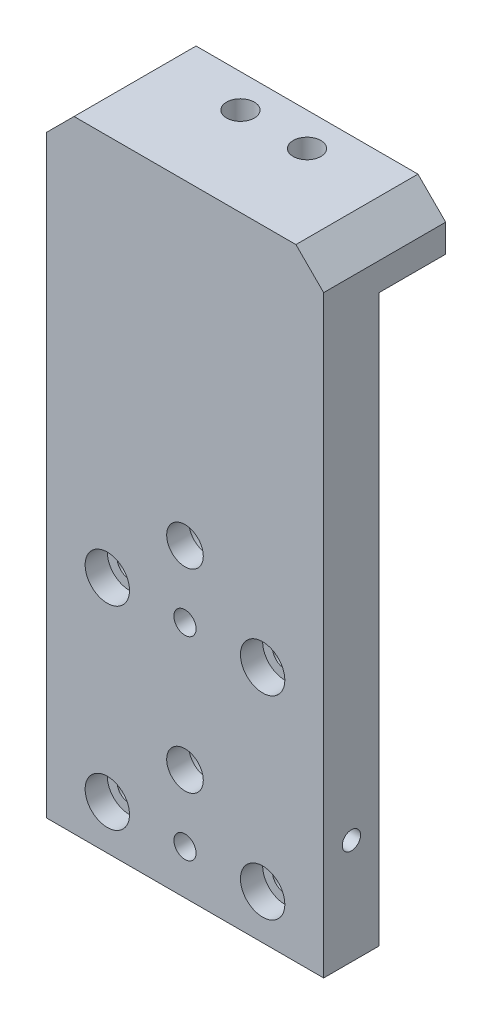
ISO-10303-21;
HEADER;
FILE_DESCRIPTION(('STEP AP214'),'2;1');
FILE_NAME('part.step','',(''),(''),'','','');
FILE_SCHEMA(('AUTOMOTIVE_DESIGN { 1 0 10303 214 1 1 1 1 }'));
ENDSEC;
DATA;
#1=APPLICATION_CONTEXT('core data for automotive mechanical design processes');
#2=APPLICATION_PROTOCOL_DEFINITION('international standard','automotive_design',2000,#1);
#3=PRODUCT_CONTEXT('',#1,'mechanical');
#4=PRODUCT('Part','Part','',(#3));
#5=PRODUCT_RELATED_PRODUCT_CATEGORY('part','',(#4));
#6=PRODUCT_DEFINITION_FORMATION('','',#4);
#7=PRODUCT_DEFINITION_CONTEXT('part definition',#1,'design');
#8=PRODUCT_DEFINITION('design','',#6,#7);
#9=PRODUCT_DEFINITION_SHAPE('','',#8);
#10=(LENGTH_UNIT() NAMED_UNIT(*) SI_UNIT(.MILLI.,.METRE.));
#11=(NAMED_UNIT(*) PLANE_ANGLE_UNIT() SI_UNIT($,.RADIAN.));
#12=(NAMED_UNIT(*) SI_UNIT($,.STERADIAN.) SOLID_ANGLE_UNIT());
#13=UNCERTAINTY_MEASURE_WITH_UNIT(LENGTH_MEASURE(1.E-05),#10,'distance_accuracy_value','');
#14=(GEOMETRIC_REPRESENTATION_CONTEXT(3) GLOBAL_UNCERTAINTY_ASSIGNED_CONTEXT((#13)) GLOBAL_UNIT_ASSIGNED_CONTEXT((#10,
#11,#12)) REPRESENTATION_CONTEXT('',''));
#15=CARTESIAN_POINT('',(0.,0.,0.));
#16=DIRECTION('',(0.,0.,1.));
#17=DIRECTION('',(1.,0.,0.));
#18=AXIS2_PLACEMENT_3D('',#15,#16,#17);
#19=CARTESIAN_POINT('',(0.,0.,0.));
#20=DIRECTION('',(0.,0.,1.));
#21=DIRECTION('',(1.,0.,0.));
#22=AXIS2_PLACEMENT_3D('',#19,#20,#21);
#23=PLANE('',#22);
#24=CARTESIAN_POINT('',(4.32330827067674,-79.8458646616541,0.));
#25=DIRECTION('',(0.,0.,1.));
#26=DIRECTION('',(1.,0.,0.));
#27=AXIS2_PLACEMENT_3D('',#24,#25,#26);
#28=CIRCLE('',#27,2.);
#29=CARTESIAN_POINT('',(6.32330827067674,-79.8458646616541,0.));
#30=VERTEX_POINT('',#29);
#31=EDGE_CURVE('E194',#30,#30,#28,.T.);
#32=ORIENTED_EDGE('',*,*,#31,.T.);
#33=EDGE_LOOP('',(#32));
#34=FACE_BOUND('',#33,.T.);
#35=CARTESIAN_POINT('',(18.3233082706767,-44.8458646616541,0.));
#36=DIRECTION('',(0.,0.,1.));
#37=DIRECTION('',(1.,0.,0.));
#38=AXIS2_PLACEMENT_3D('',#35,#36,#37);
#39=CIRCLE('',#38,2.25);
#40=CARTESIAN_POINT('',(20.5733082706767,-44.8458646616541,0.));
#41=VERTEX_POINT('',#40);
#42=EDGE_CURVE('E193',#41,#41,#39,.T.);
#43=ORIENTED_EDGE('',*,*,#42,.T.);
#44=EDGE_LOOP('',(#43));
#45=FACE_BOUND('',#44,.T.);
#46=CARTESIAN_POINT('',(-9.67669172932327,-44.8458646616541,0.));
#47=DIRECTION('',(0.,0.,1.));
#48=DIRECTION('',(1.,0.,0.));
#49=AXIS2_PLACEMENT_3D('',#46,#47,#48);
#50=CIRCLE('',#49,2.25);
#51=CARTESIAN_POINT('',(-7.42669172932326,-44.8458646616541,0.));
#52=VERTEX_POINT('',#51);
#53=EDGE_CURVE('E199',#52,#52,#50,.T.);
#54=ORIENTED_EDGE('',*,*,#53,.T.);
#55=EDGE_LOOP('',(#54));
#56=FACE_BOUND('',#55,.T.);
#57=CARTESIAN_POINT('',(-9.67669172932327,-79.8458646616541,0.));
#58=DIRECTION('',(0.,0.,1.));
#59=DIRECTION('',(1.,0.,0.));
#60=AXIS2_PLACEMENT_3D('',#57,#58,#59);
#61=CIRCLE('',#60,2.25);
#62=CARTESIAN_POINT('',(-7.42669172932326,-79.8458646616541,0.));
#63=VERTEX_POINT('',#62);
#64=EDGE_CURVE('E202',#63,#63,#61,.T.);
#65=ORIENTED_EDGE('',*,*,#64,.T.);
#66=EDGE_LOOP('',(#65));
#67=FACE_BOUND('',#66,.T.);
#68=CARTESIAN_POINT('',(18.3233082706767,-79.8458646616541,0.));
#69=DIRECTION('',(0.,0.,1.));
#70=DIRECTION('',(1.,0.,0.));
#71=AXIS2_PLACEMENT_3D('',#68,#69,#70);
#72=CIRCLE('',#71,2.25);
#73=CARTESIAN_POINT('',(20.5733082706767,-79.8458646616541,0.));
#74=VERTEX_POINT('',#73);
#75=EDGE_CURVE('E205',#74,#74,#72,.T.);
#76=ORIENTED_EDGE('',*,*,#75,.T.);
#77=EDGE_LOOP('',(#76));
#78=FACE_BOUND('',#77,.T.);
#79=CARTESIAN_POINT('',(4.32330827067674,-44.8458646616541,0.));
#80=DIRECTION('',(0.,0.,1.));
#81=DIRECTION('',(1.,0.,0.));
#82=AXIS2_PLACEMENT_3D('',#79,#80,#81);
#83=CIRCLE('',#82,2.);
#84=CARTESIAN_POINT('',(6.32330827067674,-44.8458646616541,0.));
#85=VERTEX_POINT('',#84);
#86=EDGE_CURVE('E211',#85,#85,#83,.T.);
#87=ORIENTED_EDGE('',*,*,#86,.T.);
#88=EDGE_LOOP('',(#87));
#89=FACE_BOUND('',#88,.T.);
#90=CARTESIAN_POINT('',(4.32330827067674,-32.8458646616541,0.));
#91=DIRECTION('',(0.,0.,-1.));
#92=DIRECTION('',(-1.,0.,0.));
#93=AXIS2_PLACEMENT_3D('',#90,#91,#92);
#94=CIRCLE('',#93,5.5);
#95=CARTESIAN_POINT('',(-1.17669172932326,-32.8458646616541,0.));
#96=VERTEX_POINT('',#95);
#97=EDGE_CURVE('E187',#96,#96,#94,.T.);
#98=ORIENTED_EDGE('',*,*,#97,.F.);
#99=EDGE_LOOP('',(#98));
#100=FACE_BOUND('',#99,.T.);
#101=CARTESIAN_POINT('',(4.32330827067674,-67.8458646616541,0.));
#102=DIRECTION('',(0.,0.,-1.));
#103=DIRECTION('',(-1.,0.,0.));
#104=AXIS2_PLACEMENT_3D('',#101,#102,#103);
#105=CIRCLE('',#104,5.5);
#106=CARTESIAN_POINT('',(-1.17669172932326,-67.8458646616541,0.));
#107=VERTEX_POINT('',#106);
#108=EDGE_CURVE('E180',#107,#107,#105,.T.);
#109=ORIENTED_EDGE('',*,*,#108,.F.);
#110=EDGE_LOOP('',(#109));
#111=FACE_BOUND('',#110,.T.);
#112=DIRECTION('',(-1.,0.,0.));
#113=VECTOR('',#112,1.);
#114=CARTESIAN_POINT('',(29.3233082706767,14.1541353383459,0.));
#115=LINE('',#114,#113);
#116=CARTESIAN_POINT('',(29.3233082706767,14.1541353383459,0.));
#117=VERTEX_POINT('',#116);
#118=CARTESIAN_POINT('',(-20.6766917293233,14.1541353383459,0.));
#119=VERTEX_POINT('',#118);
#120=EDGE_CURVE('E130',#117,#119,#115,.T.);
#121=ORIENTED_EDGE('',*,*,#120,.F.);
#122=DIRECTION('',(0.,1.,0.));
#123=VECTOR('',#122,1.);
#124=CARTESIAN_POINT('',(29.3233082706767,24.1541353383459,0.));
#125=LINE('',#124,#123);
#126=CARTESIAN_POINT('',(29.3233082706767,-87.8458646616541,0.));
#127=VERTEX_POINT('',#126);
#128=EDGE_CURVE('E224',#127,#117,#125,.T.);
#129=ORIENTED_EDGE('',*,*,#128,.F.);
#130=DIRECTION('',(1.,0.,0.));
#131=VECTOR('',#130,1.);
#132=CARTESIAN_POINT('',(-20.6766917293233,-87.8458646616541,0.));
#133=LINE('',#132,#131);
#134=CARTESIAN_POINT('',(-20.6766917293233,-87.8458646616541,0.));
#135=VERTEX_POINT('',#134);
#136=EDGE_CURVE('E232',#135,#127,#133,.T.);
#137=ORIENTED_EDGE('',*,*,#136,.F.);
#138=DIRECTION('',(0.,-1.,0.));
#139=VECTOR('',#138,1.);
#140=CARTESIAN_POINT('',(-20.6766917293233,24.1541353383459,0.));
#141=LINE('',#140,#139);
#142=EDGE_CURVE('E220',#119,#135,#141,.T.);
#143=ORIENTED_EDGE('',*,*,#142,.F.);
#144=EDGE_LOOP('',(#121,#129,#137,#143));
#145=FACE_BOUND('',#144,.T.);
#146=ADVANCED_FACE('F35',(#34,#45,#56,#67,#78,#89,#100,#111,#145),#23,.F.);
#147=CARTESIAN_POINT('',(18.3233082706767,-79.8458646616541,10.));
#148=DIRECTION('',(0.,0.,-1.));
#149=DIRECTION('',(-1.,0.,0.));
#150=AXIS2_PLACEMENT_3D('',#147,#148,#149);
#151=CYLINDRICAL_SURFACE('',#150,2.25);
#152=ORIENTED_EDGE('',*,*,#75,.F.);
#153=EDGE_LOOP('',(#152));
#154=FACE_BOUND('',#153,.T.);
#155=CARTESIAN_POINT('',(18.3233082706767,-79.8458646616541,6.));
#156=DIRECTION('',(0.,0.,1.));
#157=DIRECTION('',(1.,0.,0.));
#158=AXIS2_PLACEMENT_3D('',#155,#156,#157);
#159=CIRCLE('',#158,2.25);
#160=CARTESIAN_POINT('',(20.5733082706767,-79.8458646616541,6.));
#161=VERTEX_POINT('',#160);
#162=EDGE_CURVE('E175',#161,#161,#159,.T.);
#163=ORIENTED_EDGE('',*,*,#162,.T.);
#164=EDGE_LOOP('',(#163));
#165=FACE_BOUND('',#164,.T.);
#166=ADVANCED_FACE('F309',(#154,#165),#151,.F.);
#167=CARTESIAN_POINT('',(-9.67669172932327,-79.8458646616541,10.));
#168=DIRECTION('',(0.,0.,-1.));
#169=DIRECTION('',(-1.,0.,0.));
#170=AXIS2_PLACEMENT_3D('',#167,#168,#169);
#171=CYLINDRICAL_SURFACE('',#170,2.25);
#172=ORIENTED_EDGE('',*,*,#64,.F.);
#173=EDGE_LOOP('',(#172));
#174=FACE_BOUND('',#173,.T.);
#175=CARTESIAN_POINT('',(-9.67669172932327,-79.8458646616541,6.));
#176=DIRECTION('',(0.,0.,1.));
#177=DIRECTION('',(1.,0.,0.));
#178=AXIS2_PLACEMENT_3D('',#175,#176,#177);
#179=CIRCLE('',#178,2.25);
#180=CARTESIAN_POINT('',(-7.42669172932326,-79.8458646616541,6.));
#181=VERTEX_POINT('',#180);
#182=EDGE_CURVE('E250',#181,#181,#179,.T.);
#183=ORIENTED_EDGE('',*,*,#182,.T.);
#184=EDGE_LOOP('',(#183));
#185=FACE_BOUND('',#184,.T.);
#186=ADVANCED_FACE('F315',(#174,#185),#171,.F.);
#187=CARTESIAN_POINT('',(18.3233082706767,-44.8458646616541,10.));
#188=DIRECTION('',(0.,0.,-1.));
#189=DIRECTION('',(-1.,0.,0.));
#190=AXIS2_PLACEMENT_3D('',#187,#188,#189);
#191=CYLINDRICAL_SURFACE('',#190,2.25);
#192=ORIENTED_EDGE('',*,*,#42,.F.);
#193=EDGE_LOOP('',(#192));
#194=FACE_BOUND('',#193,.T.);
#195=CARTESIAN_POINT('',(18.3233082706767,-44.8458646616541,6.));
#196=DIRECTION('',(0.,0.,1.));
#197=DIRECTION('',(1.,0.,0.));
#198=AXIS2_PLACEMENT_3D('',#195,#196,#197);
#199=CIRCLE('',#198,2.25);
#200=CARTESIAN_POINT('',(20.5733082706767,-44.8458646616541,6.));
#201=VERTEX_POINT('',#200);
#202=EDGE_CURVE('E153',#201,#201,#199,.T.);
#203=ORIENTED_EDGE('',*,*,#202,.T.);
#204=EDGE_LOOP('',(#203));
#205=FACE_BOUND('',#204,.T.);
#206=ADVANCED_FACE('F424',(#194,#205),#191,.F.);
#207=CARTESIAN_POINT('',(-9.67669172932327,-44.8458646616541,10.));
#208=DIRECTION('',(0.,0.,-1.));
#209=DIRECTION('',(-1.,0.,0.));
#210=AXIS2_PLACEMENT_3D('',#207,#208,#209);
#211=CYLINDRICAL_SURFACE('',#210,2.25);
#212=ORIENTED_EDGE('',*,*,#53,.F.);
#213=EDGE_LOOP('',(#212));
#214=FACE_BOUND('',#213,.T.);
#215=CARTESIAN_POINT('',(-9.67669172932327,-44.8458646616541,6.));
#216=DIRECTION('',(0.,0.,1.));
#217=DIRECTION('',(1.,0.,0.));
#218=AXIS2_PLACEMENT_3D('',#215,#216,#217);
#219=CIRCLE('',#218,2.25);
#220=CARTESIAN_POINT('',(-7.42669172932326,-44.8458646616541,6.));
#221=VERTEX_POINT('',#220);
#222=EDGE_CURVE('E171',#221,#221,#219,.T.);
#223=ORIENTED_EDGE('',*,*,#222,.T.);
#224=EDGE_LOOP('',(#223));
#225=FACE_BOUND('',#224,.T.);
#226=ADVANCED_FACE('F427',(#214,#225),#211,.F.);
#227=CARTESIAN_POINT('',(4.32330827067674,-67.8458646616541,10.));
#228=DIRECTION('',(0.,0.,-1.));
#229=DIRECTION('',(-1.,0.,0.));
#230=AXIS2_PLACEMENT_3D('',#227,#228,#229);
#231=CYLINDRICAL_SURFACE('',#230,3.3);
#232=CARTESIAN_POINT('',(4.32330827067674,-67.8458646616541,10.));
#233=DIRECTION('',(0.,0.,1.));
#234=DIRECTION('',(1.,0.,0.));
#235=AXIS2_PLACEMENT_3D('',#232,#233,#234);
#236=CIRCLE('',#235,3.3);
#237=CARTESIAN_POINT('',(7.62330827067673,-67.8458646616541,10.));
#238=VERTEX_POINT('',#237);
#239=EDGE_CURVE('E215',#238,#238,#236,.T.);
#240=ORIENTED_EDGE('',*,*,#239,.T.);
#241=EDGE_LOOP('',(#240));
#242=FACE_BOUND('',#241,.T.);
#243=CARTESIAN_POINT('',(4.32330827067674,-67.8458646616541,6.));
#244=DIRECTION('',(0.,0.,-1.));
#245=DIRECTION('',(-1.,0.,0.));
#246=AXIS2_PLACEMENT_3D('',#243,#244,#245);
#247=CIRCLE('',#246,3.3);
#248=CARTESIAN_POINT('',(1.02330827067674,-67.8458646616541,6.));
#249=VERTEX_POINT('',#248);
#250=EDGE_CURVE('E179',#249,#249,#247,.T.);
#251=ORIENTED_EDGE('',*,*,#250,.T.);
#252=EDGE_LOOP('',(#251));
#253=FACE_BOUND('',#252,.T.);
#254=ADVANCED_FACE('F431',(#242,#253),#231,.F.);
#255=CARTESIAN_POINT('',(4.32330827067674,-32.8458646616541,10.));
#256=DIRECTION('',(0.,0.,-1.));
#257=DIRECTION('',(-1.,0.,0.));
#258=AXIS2_PLACEMENT_3D('',#255,#256,#257);
#259=CYLINDRICAL_SURFACE('',#258,3.3);
#260=CARTESIAN_POINT('',(4.32330827067674,-32.8458646616541,10.));
#261=DIRECTION('',(0.,0.,1.));
#262=DIRECTION('',(1.,0.,0.));
#263=AXIS2_PLACEMENT_3D('',#260,#261,#262);
#264=CIRCLE('',#263,3.3);
#265=CARTESIAN_POINT('',(7.62330827067673,-32.8458646616541,10.));
#266=VERTEX_POINT('',#265);
#267=EDGE_CURVE('E208',#266,#266,#264,.T.);
#268=ORIENTED_EDGE('',*,*,#267,.T.);
#269=EDGE_LOOP('',(#268));
#270=FACE_BOUND('',#269,.T.);
#271=CARTESIAN_POINT('',(4.32330827067674,-32.8458646616541,6.));
#272=DIRECTION('',(0.,0.,-1.));
#273=DIRECTION('',(-1.,0.,0.));
#274=AXIS2_PLACEMENT_3D('',#271,#272,#273);
#275=CIRCLE('',#274,3.3);
#276=CARTESIAN_POINT('',(1.02330827067674,-32.8458646616541,6.));
#277=VERTEX_POINT('',#276);
#278=EDGE_CURVE('E186',#277,#277,#275,.T.);
#279=ORIENTED_EDGE('',*,*,#278,.T.);
#280=EDGE_LOOP('',(#279));
#281=FACE_BOUND('',#280,.T.);
#282=ADVANCED_FACE('F436',(#270,#281),#259,.F.);
#283=CARTESIAN_POINT('',(0.,0.,10.));
#284=DIRECTION('',(0.,0.,1.));
#285=DIRECTION('',(1.,0.,0.));
#286=AXIS2_PLACEMENT_3D('',#283,#284,#285);
#287=PLANE('',#286);
#288=CARTESIAN_POINT('',(18.3233082706767,-44.8458646616541,10.));
#289=DIRECTION('',(0.,0.,1.));
#290=DIRECTION('',(1.,0.,0.));
#291=AXIS2_PLACEMENT_3D('',#288,#289,#290);
#292=CIRCLE('',#291,4.);
#293=CARTESIAN_POINT('',(22.3233082706767,-44.8458646616541,10.));
#294=VERTEX_POINT('',#293);
#295=EDGE_CURVE('E154',#294,#294,#292,.T.);
#296=ORIENTED_EDGE('',*,*,#295,.F.);
#297=EDGE_LOOP('',(#296));
#298=FACE_BOUND('',#297,.T.);
#299=CARTESIAN_POINT('',(18.3233082706767,-79.8458646616541,10.));
#300=DIRECTION('',(0.,0.,1.));
#301=DIRECTION('',(1.,0.,0.));
#302=AXIS2_PLACEMENT_3D('',#299,#300,#301);
#303=CIRCLE('',#302,4.);
#304=CARTESIAN_POINT('',(22.3233082706767,-79.8458646616541,10.));
#305=VERTEX_POINT('',#304);
#306=EDGE_CURVE('E160',#305,#305,#303,.T.);
#307=ORIENTED_EDGE('',*,*,#306,.F.);
#308=EDGE_LOOP('',(#307));
#309=FACE_BOUND('',#308,.T.);
#310=CARTESIAN_POINT('',(-9.67669172932327,-79.8458646616541,10.));
#311=DIRECTION('',(0.,0.,1.));
#312=DIRECTION('',(1.,0.,0.));
#313=AXIS2_PLACEMENT_3D('',#310,#311,#312);
#314=CIRCLE('',#313,4.);
#315=CARTESIAN_POINT('',(-5.67669172932326,-79.8458646616541,10.));
#316=VERTEX_POINT('',#315);
#317=EDGE_CURVE('E149',#316,#316,#314,.T.);
#318=ORIENTED_EDGE('',*,*,#317,.F.);
#319=EDGE_LOOP('',(#318));
#320=FACE_BOUND('',#319,.T.);
#321=CARTESIAN_POINT('',(-9.67669172932327,-44.8458646616541,10.));
#322=DIRECTION('',(0.,0.,1.));
#323=DIRECTION('',(1.,0.,0.));
#324=AXIS2_PLACEMENT_3D('',#321,#322,#323);
#325=CIRCLE('',#324,4.);
#326=CARTESIAN_POINT('',(-5.67669172932326,-44.8458646616541,10.));
#327=VERTEX_POINT('',#326);
#328=EDGE_CURVE('E172',#327,#327,#325,.T.);
#329=ORIENTED_EDGE('',*,*,#328,.F.);
#330=EDGE_LOOP('',(#329));
#331=FACE_BOUND('',#330,.T.);
#332=ORIENTED_EDGE('',*,*,#267,.F.);
#333=EDGE_LOOP('',(#332));
#334=FACE_BOUND('',#333,.T.);
#335=ORIENTED_EDGE('',*,*,#239,.F.);
#336=EDGE_LOOP('',(#335));
#337=FACE_BOUND('',#336,.T.);
#338=DIRECTION('',(-1.,0.,0.));
#339=VECTOR('',#338,1.);
#340=CARTESIAN_POINT('',(-20.6766917293233,24.1541353383459,10.));
#341=LINE('',#340,#339);
#342=CARTESIAN_POINT('',(24.3233082706767,24.1541353383459,10.));
#343=VERTEX_POINT('',#342);
#344=CARTESIAN_POINT('',(-15.6766917293233,24.1541353383459,10.));
#345=VERTEX_POINT('',#344);
#346=EDGE_CURVE('E228',#343,#345,#341,.T.);
#347=ORIENTED_EDGE('',*,*,#346,.T.);
#348=DIRECTION('',(0.707106781186549,0.707106781186547,0.));
#349=VECTOR('',#348,1.);
#350=CARTESIAN_POINT('',(-19.9154135338345,19.9154135338346,10.));
#351=LINE('',#350,#349);
#352=CARTESIAN_POINT('',(-20.6766917293233,19.1541353383459,10.));
#353=VERTEX_POINT('',#352);
#354=EDGE_CURVE('E44',#345,#353,#351,.F.);
#355=ORIENTED_EDGE('',*,*,#354,.T.);
#356=DIRECTION('',(0.,-1.,0.));
#357=VECTOR('',#356,1.);
#358=CARTESIAN_POINT('',(-20.6766917293233,24.1541353383459,10.));
#359=LINE('',#358,#357);
#360=CARTESIAN_POINT('',(-20.6766917293233,-87.8458646616541,10.));
#361=VERTEX_POINT('',#360);
#362=EDGE_CURVE('E221',#353,#361,#359,.T.);
#363=ORIENTED_EDGE('',*,*,#362,.T.);
#364=DIRECTION('',(1.,0.,0.));
#365=VECTOR('',#364,1.);
#366=CARTESIAN_POINT('',(-20.6766917293233,-87.8458646616541,10.));
#367=LINE('',#366,#365);
#368=CARTESIAN_POINT('',(29.3233082706767,-87.8458646616541,10.));
#369=VERTEX_POINT('',#368);
#370=EDGE_CURVE('E223',#361,#369,#367,.T.);
#371=ORIENTED_EDGE('',*,*,#370,.T.);
#372=DIRECTION('',(0.,1.,0.));
#373=VECTOR('',#372,1.);
#374=CARTESIAN_POINT('',(29.3233082706767,24.1541353383459,10.));
#375=LINE('',#374,#373);
#376=CARTESIAN_POINT('',(29.3233082706767,19.1541353383458,10.));
#377=VERTEX_POINT('',#376);
#378=EDGE_CURVE('E226',#369,#377,#375,.T.);
#379=ORIENTED_EDGE('',*,*,#378,.T.);
#380=DIRECTION('',(0.707106781186547,-0.707106781186549,0.));
#381=VECTOR('',#380,1.);
#382=CARTESIAN_POINT('',(24.2387218045113,24.2387218045113,10.));
#383=LINE('',#382,#381);
#384=EDGE_CURVE('E265',#377,#343,#383,.F.);
#385=ORIENTED_EDGE('',*,*,#384,.T.);
#386=EDGE_LOOP('',(#347,#355,#363,#371,#379,#385));
#387=FACE_BOUND('',#386,.T.);
#388=CARTESIAN_POINT('',(4.32330827067674,-44.8458646616541,10.));
#389=DIRECTION('',(0.,0.,1.));
#390=DIRECTION('',(1.,0.,0.));
#391=AXIS2_PLACEMENT_3D('',#388,#389,#390);
#392=CIRCLE('',#391,2.);
#393=CARTESIAN_POINT('',(6.32330827067674,-44.8458646616541,10.));
#394=VERTEX_POINT('',#393);
#395=EDGE_CURVE('E212',#394,#394,#392,.T.);
#396=ORIENTED_EDGE('',*,*,#395,.F.);
#397=EDGE_LOOP('',(#396));
#398=FACE_BOUND('',#397,.T.);
#399=CARTESIAN_POINT('',(4.32330827067674,-79.8458646616541,10.));
#400=DIRECTION('',(0.,0.,1.));
#401=DIRECTION('',(1.,0.,0.));
#402=AXIS2_PLACEMENT_3D('',#399,#400,#401);
#403=CIRCLE('',#402,2.);
#404=CARTESIAN_POINT('',(6.32330827067674,-79.8458646616541,10.));
#405=VERTEX_POINT('',#404);
#406=EDGE_CURVE('E190',#405,#405,#403,.T.);
#407=ORIENTED_EDGE('',*,*,#406,.F.);
#408=EDGE_LOOP('',(#407));
#409=FACE_BOUND('',#408,.T.);
#410=ADVANCED_FACE('F270',(#298,#309,#320,#331,#334,#337,#387,#398,#409),#287,.T.);
#411=CARTESIAN_POINT('',(-20.6766917293233,24.1541353383459,10.));
#412=DIRECTION('',(1.,0.,0.));
#413=DIRECTION('',(0.,1.,0.));
#414=AXIS2_PLACEMENT_3D('',#411,#412,#413);
#415=PLANE('',#414);
#416=CARTESIAN_POINT('',(-20.6766917293233,-68.8458646616541,5.));
#417=DIRECTION('',(-1.,0.,0.));
#418=DIRECTION('',(0.,0.,1.));
#419=AXIS2_PLACEMENT_3D('',#416,#417,#418);
#420=CIRCLE('',#419,1.64999999999998);
#421=CARTESIAN_POINT('',(-20.6766917293233,-68.8458646616541,6.64999999999999));
#422=VERTEX_POINT('',#421);
#423=EDGE_CURVE('E118',#422,#422,#420,.T.);
#424=ORIENTED_EDGE('',*,*,#423,.F.);
#425=EDGE_LOOP('',(#424));
#426=FACE_BOUND('',#425,.T.);
#427=ORIENTED_EDGE('',*,*,#362,.F.);
#428=DIRECTION('',(0.,0.,-1.));
#429=VECTOR('',#428,1.);
#430=CARTESIAN_POINT('',(-20.6766917293233,19.1541353383459,10.));
#431=LINE('',#430,#429);
#432=CARTESIAN_POINT('',(-20.6766917293233,19.1541353383459,-12.));
#433=VERTEX_POINT('',#432);
#434=EDGE_CURVE('E241',#353,#433,#431,.T.);
#435=ORIENTED_EDGE('',*,*,#434,.T.);
#436=DIRECTION('',(0.,1.,0.));
#437=VECTOR('',#436,1.);
#438=CARTESIAN_POINT('',(-20.6766917293233,24.1541353383459,-12.));
#439=LINE('',#438,#437);
#440=CARTESIAN_POINT('',(-20.6766917293233,14.1541353383459,-12.));
#441=VERTEX_POINT('',#440);
#442=EDGE_CURVE('E135',#441,#433,#439,.T.);
#443=ORIENTED_EDGE('',*,*,#442,.F.);
#444=DIRECTION('',(0.,0.,1.));
#445=VECTOR('',#444,1.);
#446=CARTESIAN_POINT('',(-20.6766917293233,14.1541353383459,-12.));
#447=LINE('',#446,#445);
#448=EDGE_CURVE('E141',#441,#119,#447,.T.);
#449=ORIENTED_EDGE('',*,*,#448,.T.);
#450=ORIENTED_EDGE('',*,*,#142,.T.);
#451=DIRECTION('',(0.,0.,-1.));
#452=VECTOR('',#451,1.);
#453=CARTESIAN_POINT('',(-20.6766917293233,-87.8458646616541,10.));
#454=LINE('',#453,#452);
#455=EDGE_CURVE('E238',#361,#135,#454,.T.);
#456=ORIENTED_EDGE('',*,*,#455,.F.);
#457=EDGE_LOOP('',(#427,#435,#443,#449,#450,#456));
#458=FACE_BOUND('',#457,.T.);
#459=ADVANCED_FACE('F277',(#426,#458),#415,.F.);
#460=CARTESIAN_POINT('',(-20.6766917293233,-87.8458646616541,10.));
#461=DIRECTION('',(0.,1.,0.));
#462=DIRECTION('',(0.,0.,1.));
#463=AXIS2_PLACEMENT_3D('',#460,#461,#462);
#464=PLANE('',#463);
#465=ORIENTED_EDGE('',*,*,#136,.T.);
#466=DIRECTION('',(0.,0.,-1.));
#467=VECTOR('',#466,1.);
#468=CARTESIAN_POINT('',(29.3233082706767,-87.8458646616541,10.));
#469=LINE('',#468,#467);
#470=EDGE_CURVE('E230',#369,#127,#469,.T.);
#471=ORIENTED_EDGE('',*,*,#470,.F.);
#472=ORIENTED_EDGE('',*,*,#370,.F.);
#473=ORIENTED_EDGE('',*,*,#455,.T.);
#474=EDGE_LOOP('',(#465,#471,#472,#473));
#475=FACE_BOUND('',#474,.T.);
#476=ADVANCED_FACE('F297',(#475),#464,.F.);
#477=CARTESIAN_POINT('',(29.3233082706767,24.1541353383459,10.));
#478=DIRECTION('',(-1.,0.,0.));
#479=DIRECTION('',(0.,-1.,0.));
#480=AXIS2_PLACEMENT_3D('',#477,#478,#479);
#481=PLANE('',#480);
#482=CARTESIAN_POINT('',(29.3233082706767,-68.8458646616541,5.));
#483=DIRECTION('',(1.,0.,0.));
#484=DIRECTION('',(0.,0.,-1.));
#485=AXIS2_PLACEMENT_3D('',#482,#483,#484);
#486=CIRCLE('',#485,1.65);
#487=CARTESIAN_POINT('',(29.3233082706767,-68.8458646616541,3.35));
#488=VERTEX_POINT('',#487);
#489=EDGE_CURVE('E117',#488,#488,#486,.T.);
#490=ORIENTED_EDGE('',*,*,#489,.F.);
#491=EDGE_LOOP('',(#490));
#492=FACE_BOUND('',#491,.T.);
#493=DIRECTION('',(0.,-1.,0.));
#494=VECTOR('',#493,1.);
#495=CARTESIAN_POINT('',(29.3233082706767,24.1541353383459,-12.));
#496=LINE('',#495,#494);
#497=CARTESIAN_POINT('',(29.3233082706767,19.1541353383458,-12.));
#498=VERTEX_POINT('',#497);
#499=CARTESIAN_POINT('',(29.3233082706767,14.1541353383459,-12.));
#500=VERTEX_POINT('',#499);
#501=EDGE_CURVE('E131',#498,#500,#496,.T.);
#502=ORIENTED_EDGE('',*,*,#501,.F.);
#503=DIRECTION('',(0.,0.,1.));
#504=VECTOR('',#503,1.);
#505=CARTESIAN_POINT('',(29.3233082706767,19.1541353383458,10.));
#506=LINE('',#505,#504);
#507=EDGE_CURVE('E11',#498,#377,#506,.T.);
#508=ORIENTED_EDGE('',*,*,#507,.T.);
#509=ORIENTED_EDGE('',*,*,#378,.F.);
#510=ORIENTED_EDGE('',*,*,#470,.T.);
#511=ORIENTED_EDGE('',*,*,#128,.T.);
#512=DIRECTION('',(0.,0.,1.));
#513=VECTOR('',#512,1.);
#514=CARTESIAN_POINT('',(29.3233082706767,14.1541353383459,-12.));
#515=LINE('',#514,#513);
#516=EDGE_CURVE('E146',#500,#117,#515,.T.);
#517=ORIENTED_EDGE('',*,*,#516,.F.);
#518=EDGE_LOOP('',(#502,#508,#509,#510,#511,#517));
#519=FACE_BOUND('',#518,.T.);
#520=ADVANCED_FACE('F288',(#492,#519),#481,.F.);
#521=CARTESIAN_POINT('',(-20.6766917293233,24.1541353383459,10.));
#522=DIRECTION('',(0.,-1.,0.));
#523=DIRECTION('',(0.,0.,-1.));
#524=AXIS2_PLACEMENT_3D('',#521,#522,#523);
#525=PLANE('',#524);
#526=CARTESIAN_POINT('',(10.3233082706767,24.1541353383459,-6.));
#527=DIRECTION('',(0.,1.,0.));
#528=DIRECTION('',(0.,0.,1.));
#529=AXIS2_PLACEMENT_3D('',#526,#527,#528);
#530=CIRCLE('',#529,2.5);
#531=CARTESIAN_POINT('',(10.3233082706767,24.1541353383459,-3.5));
#532=VERTEX_POINT('',#531);
#533=EDGE_CURVE('E334',#532,#532,#530,.T.);
#534=ORIENTED_EDGE('',*,*,#533,.F.);
#535=EDGE_LOOP('',(#534));
#536=FACE_BOUND('',#535,.T.);
#537=CARTESIAN_POINT('',(-1.67669172932328,24.1541353383459,-6.));
#538=DIRECTION('',(0.,1.,0.));
#539=DIRECTION('',(0.,0.,1.));
#540=AXIS2_PLACEMENT_3D('',#537,#538,#539);
#541=CIRCLE('',#540,2.5);
#542=CARTESIAN_POINT('',(-1.67669172932328,24.1541353383459,-3.5));
#543=VERTEX_POINT('',#542);
#544=EDGE_CURVE('E337',#543,#543,#541,.T.);
#545=ORIENTED_EDGE('',*,*,#544,.F.);
#546=EDGE_LOOP('',(#545));
#547=FACE_BOUND('',#546,.T.);
#548=DIRECTION('',(1.,0.,0.));
#549=VECTOR('',#548,1.);
#550=CARTESIAN_POINT('',(29.3233082706767,24.1541353383459,-12.));
#551=LINE('',#550,#549);
#552=CARTESIAN_POINT('',(-15.6766917293233,24.1541353383459,-12.));
#553=VERTEX_POINT('',#552);
#554=CARTESIAN_POINT('',(24.3233082706767,24.1541353383459,-12.));
#555=VERTEX_POINT('',#554);
#556=EDGE_CURVE('E138',#553,#555,#551,.T.);
#557=ORIENTED_EDGE('',*,*,#556,.F.);
#558=DIRECTION('',(0.,0.,1.));
#559=VECTOR('',#558,1.);
#560=CARTESIAN_POINT('',(-15.6766917293233,24.1541353383459,10.));
#561=LINE('',#560,#559);
#562=EDGE_CURVE('E57',#553,#345,#561,.T.);
#563=ORIENTED_EDGE('',*,*,#562,.T.);
#564=ORIENTED_EDGE('',*,*,#346,.F.);
#565=DIRECTION('',(0.,0.,-1.));
#566=VECTOR('',#565,1.);
#567=CARTESIAN_POINT('',(24.3233082706767,24.1541353383459,10.));
#568=LINE('',#567,#566);
#569=EDGE_CURVE('E261',#343,#555,#568,.T.);
#570=ORIENTED_EDGE('',*,*,#569,.T.);
#571=EDGE_LOOP('',(#557,#563,#564,#570));
#572=FACE_BOUND('',#571,.T.);
#573=ADVANCED_FACE('F282',(#536,#547,#572),#525,.F.);
#574=CARTESIAN_POINT('',(4.32330827067674,-44.8458646616541,10.));
#575=DIRECTION('',(0.,0.,-1.));
#576=DIRECTION('',(-1.,0.,0.));
#577=AXIS2_PLACEMENT_3D('',#574,#575,#576);
#578=CYLINDRICAL_SURFACE('',#577,2.);
#579=ORIENTED_EDGE('',*,*,#395,.T.);
#580=EDGE_LOOP('',(#579));
#581=FACE_BOUND('',#580,.T.);
#582=ORIENTED_EDGE('',*,*,#86,.F.);
#583=EDGE_LOOP('',(#582));
#584=FACE_BOUND('',#583,.T.);
#585=ADVANCED_FACE('F323',(#581,#584),#578,.F.);
#586=CARTESIAN_POINT('',(4.32330827067674,-79.8458646616541,10.));
#587=DIRECTION('',(0.,0.,-1.));
#588=DIRECTION('',(-1.,0.,0.));
#589=AXIS2_PLACEMENT_3D('',#586,#587,#588);
#590=CYLINDRICAL_SURFACE('',#589,2.);
#591=ORIENTED_EDGE('',*,*,#406,.T.);
#592=EDGE_LOOP('',(#591));
#593=FACE_BOUND('',#592,.T.);
#594=ORIENTED_EDGE('',*,*,#31,.F.);
#595=EDGE_LOOP('',(#594));
#596=FACE_BOUND('',#595,.T.);
#597=ADVANCED_FACE('F328',(#593,#596),#590,.F.);
#598=CARTESIAN_POINT('',(4.32330827067674,-32.8458646616541,6.));
#599=DIRECTION('',(0.,0.,-1.));
#600=DIRECTION('',(-1.,0.,0.));
#601=AXIS2_PLACEMENT_3D('',#598,#599,#600);
#602=CYLINDRICAL_SURFACE('',#601,5.5);
#603=CARTESIAN_POINT('',(4.32330827067674,-32.8458646616541,6.));
#604=DIRECTION('',(0.,0.,-1.));
#605=DIRECTION('',(-1.,0.,0.));
#606=AXIS2_PLACEMENT_3D('',#603,#604,#605);
#607=CIRCLE('',#606,5.5);
#608=CARTESIAN_POINT('',(-1.17669172932326,-32.8458646616541,6.));
#609=VERTEX_POINT('',#608);
#610=EDGE_CURVE('E183',#609,#609,#607,.T.);
#611=ORIENTED_EDGE('',*,*,#610,.F.);
#612=EDGE_LOOP('',(#611));
#613=FACE_BOUND('',#612,.T.);
#614=ORIENTED_EDGE('',*,*,#97,.T.);
#615=EDGE_LOOP('',(#614));
#616=FACE_BOUND('',#615,.T.);
#617=ADVANCED_FACE('F416',(#613,#616),#602,.F.);
#618=CARTESIAN_POINT('',(4.32330827067674,-32.8458646616541,6.));
#619=DIRECTION('',(0.,0.,-1.));
#620=DIRECTION('',(-1.,0.,0.));
#621=AXIS2_PLACEMENT_3D('',#618,#619,#620);
#622=PLANE('',#621);
#623=ORIENTED_EDGE('',*,*,#278,.F.);
#624=EDGE_LOOP('',(#623));
#625=FACE_BOUND('',#624,.T.);
#626=ORIENTED_EDGE('',*,*,#610,.T.);
#627=EDGE_LOOP('',(#626));
#628=FACE_BOUND('',#627,.T.);
#629=ADVANCED_FACE('F412',(#625,#628),#622,.T.);
#630=CARTESIAN_POINT('',(4.32330827067674,-67.8458646616541,6.));
#631=DIRECTION('',(0.,0.,-1.));
#632=DIRECTION('',(-1.,0.,0.));
#633=AXIS2_PLACEMENT_3D('',#630,#631,#632);
#634=CYLINDRICAL_SURFACE('',#633,5.5);
#635=CARTESIAN_POINT('',(4.32330827067674,-67.8458646616541,6.));
#636=DIRECTION('',(0.,0.,-1.));
#637=DIRECTION('',(-1.,0.,0.));
#638=AXIS2_PLACEMENT_3D('',#635,#636,#637);
#639=CIRCLE('',#638,5.5);
#640=CARTESIAN_POINT('',(-1.17669172932326,-67.8458646616541,6.));
#641=VERTEX_POINT('',#640);
#642=EDGE_CURVE('E176',#641,#641,#639,.T.);
#643=ORIENTED_EDGE('',*,*,#642,.F.);
#644=EDGE_LOOP('',(#643));
#645=FACE_BOUND('',#644,.T.);
#646=ORIENTED_EDGE('',*,*,#108,.T.);
#647=EDGE_LOOP('',(#646));
#648=FACE_BOUND('',#647,.T.);
#649=ADVANCED_FACE('F408',(#645,#648),#634,.F.);
#650=CARTESIAN_POINT('',(4.32330827067674,-67.8458646616541,6.));
#651=DIRECTION('',(0.,0.,-1.));
#652=DIRECTION('',(-1.,0.,0.));
#653=AXIS2_PLACEMENT_3D('',#650,#651,#652);
#654=PLANE('',#653);
#655=ORIENTED_EDGE('',*,*,#250,.F.);
#656=EDGE_LOOP('',(#655));
#657=FACE_BOUND('',#656,.T.);
#658=ORIENTED_EDGE('',*,*,#642,.T.);
#659=EDGE_LOOP('',(#658));
#660=FACE_BOUND('',#659,.T.);
#661=ADVANCED_FACE('F404',(#657,#660),#654,.T.);
#662=CARTESIAN_POINT('',(-9.67669172932327,-44.8458646616541,6.));
#663=DIRECTION('',(0.,0.,1.));
#664=DIRECTION('',(1.,0.,0.));
#665=AXIS2_PLACEMENT_3D('',#662,#663,#664);
#666=CYLINDRICAL_SURFACE('',#665,4.);
#667=CARTESIAN_POINT('',(-9.67669172932327,-44.8458646616541,6.));
#668=DIRECTION('',(0.,0.,1.));
#669=DIRECTION('',(1.,0.,0.));
#670=AXIS2_PLACEMENT_3D('',#667,#668,#669);
#671=CIRCLE('',#670,4.);
#672=CARTESIAN_POINT('',(-5.67669172932326,-44.8458646616541,6.));
#673=VERTEX_POINT('',#672);
#674=EDGE_CURVE('E168',#673,#673,#671,.T.);
#675=ORIENTED_EDGE('',*,*,#674,.F.);
#676=EDGE_LOOP('',(#675));
#677=FACE_BOUND('',#676,.T.);
#678=ORIENTED_EDGE('',*,*,#328,.T.);
#679=EDGE_LOOP('',(#678));
#680=FACE_BOUND('',#679,.T.);
#681=ADVANCED_FACE('F400',(#677,#680),#666,.F.);
#682=CARTESIAN_POINT('',(-9.67669172932327,-44.8458646616541,6.));
#683=DIRECTION('',(0.,0.,1.));
#684=DIRECTION('',(1.,0.,0.));
#685=AXIS2_PLACEMENT_3D('',#682,#683,#684);
#686=PLANE('',#685);
#687=ORIENTED_EDGE('',*,*,#222,.F.);
#688=EDGE_LOOP('',(#687));
#689=FACE_BOUND('',#688,.T.);
#690=ORIENTED_EDGE('',*,*,#674,.T.);
#691=EDGE_LOOP('',(#690));
#692=FACE_BOUND('',#691,.T.);
#693=ADVANCED_FACE('F382',(#689,#692),#686,.T.);
#694=CARTESIAN_POINT('',(18.3233082706767,-44.8458646616541,6.));
#695=DIRECTION('',(0.,0.,1.));
#696=DIRECTION('',(1.,0.,0.));
#697=AXIS2_PLACEMENT_3D('',#694,#695,#696);
#698=CYLINDRICAL_SURFACE('',#697,4.);
#699=CARTESIAN_POINT('',(18.3233082706767,-44.8458646616541,6.));
#700=DIRECTION('',(0.,0.,1.));
#701=DIRECTION('',(1.,0.,0.));
#702=AXIS2_PLACEMENT_3D('',#699,#700,#701);
#703=CIRCLE('',#702,4.);
#704=CARTESIAN_POINT('',(22.3233082706767,-44.8458646616541,6.));
#705=VERTEX_POINT('',#704);
#706=EDGE_CURVE('E150',#705,#705,#703,.T.);
#707=ORIENTED_EDGE('',*,*,#706,.F.);
#708=EDGE_LOOP('',(#707));
#709=FACE_BOUND('',#708,.T.);
#710=ORIENTED_EDGE('',*,*,#295,.T.);
#711=EDGE_LOOP('',(#710));
#712=FACE_BOUND('',#711,.T.);
#713=ADVANCED_FACE('F378',(#709,#712),#698,.F.);
#714=CARTESIAN_POINT('',(18.3233082706767,-44.8458646616541,6.));
#715=DIRECTION('',(0.,0.,1.));
#716=DIRECTION('',(1.,0.,0.));
#717=AXIS2_PLACEMENT_3D('',#714,#715,#716);
#718=PLANE('',#717);
#719=ORIENTED_EDGE('',*,*,#202,.F.);
#720=EDGE_LOOP('',(#719));
#721=FACE_BOUND('',#720,.T.);
#722=ORIENTED_EDGE('',*,*,#706,.T.);
#723=EDGE_LOOP('',(#722));
#724=FACE_BOUND('',#723,.T.);
#725=ADVANCED_FACE('F374',(#721,#724),#718,.T.);
#726=CARTESIAN_POINT('',(-9.67669172932327,-79.8458646616541,6.));
#727=DIRECTION('',(0.,0.,1.));
#728=DIRECTION('',(1.,0.,0.));
#729=AXIS2_PLACEMENT_3D('',#726,#727,#728);
#730=CYLINDRICAL_SURFACE('',#729,4.);
#731=CARTESIAN_POINT('',(-9.67669172932327,-79.8458646616541,6.));
#732=DIRECTION('',(0.,0.,1.));
#733=DIRECTION('',(1.,0.,0.));
#734=AXIS2_PLACEMENT_3D('',#731,#732,#733);
#735=CIRCLE('',#734,4.);
#736=CARTESIAN_POINT('',(-5.67669172932326,-79.8458646616541,6.));
#737=VERTEX_POINT('',#736);
#738=EDGE_CURVE('E163',#737,#737,#735,.T.);
#739=ORIENTED_EDGE('',*,*,#738,.F.);
#740=EDGE_LOOP('',(#739));
#741=FACE_BOUND('',#740,.T.);
#742=ORIENTED_EDGE('',*,*,#317,.T.);
#743=EDGE_LOOP('',(#742));
#744=FACE_BOUND('',#743,.T.);
#745=ADVANCED_FACE('F377',(#741,#744),#730,.F.);
#746=CARTESIAN_POINT('',(-9.67669172932327,-79.8458646616541,6.));
#747=DIRECTION('',(0.,0.,1.));
#748=DIRECTION('',(1.,0.,0.));
#749=AXIS2_PLACEMENT_3D('',#746,#747,#748);
#750=PLANE('',#749);
#751=ORIENTED_EDGE('',*,*,#182,.F.);
#752=EDGE_LOOP('',(#751));
#753=FACE_BOUND('',#752,.T.);
#754=ORIENTED_EDGE('',*,*,#738,.T.);
#755=EDGE_LOOP('',(#754));
#756=FACE_BOUND('',#755,.T.);
#757=ADVANCED_FACE('F390',(#753,#756),#750,.T.);
#758=CARTESIAN_POINT('',(18.3233082706767,-79.8458646616541,6.));
#759=DIRECTION('',(0.,0.,1.));
#760=DIRECTION('',(1.,0.,0.));
#761=AXIS2_PLACEMENT_3D('',#758,#759,#760);
#762=CYLINDRICAL_SURFACE('',#761,4.);
#763=CARTESIAN_POINT('',(18.3233082706767,-79.8458646616541,6.));
#764=DIRECTION('',(0.,0.,1.));
#765=DIRECTION('',(1.,0.,0.));
#766=AXIS2_PLACEMENT_3D('',#763,#764,#765);
#767=CIRCLE('',#766,4.);
#768=CARTESIAN_POINT('',(22.3233082706767,-79.8458646616541,6.));
#769=VERTEX_POINT('',#768);
#770=EDGE_CURVE('E157',#769,#769,#767,.T.);
#771=ORIENTED_EDGE('',*,*,#770,.F.);
#772=EDGE_LOOP('',(#771));
#773=FACE_BOUND('',#772,.T.);
#774=ORIENTED_EDGE('',*,*,#306,.T.);
#775=EDGE_LOOP('',(#774));
#776=FACE_BOUND('',#775,.T.);
#777=ADVANCED_FACE('F386',(#773,#776),#762,.F.);
#778=CARTESIAN_POINT('',(18.3233082706767,-79.8458646616541,6.));
#779=DIRECTION('',(0.,0.,1.));
#780=DIRECTION('',(1.,0.,0.));
#781=AXIS2_PLACEMENT_3D('',#778,#779,#780);
#782=PLANE('',#781);
#783=ORIENTED_EDGE('',*,*,#162,.F.);
#784=EDGE_LOOP('',(#783));
#785=FACE_BOUND('',#784,.T.);
#786=ORIENTED_EDGE('',*,*,#770,.T.);
#787=EDGE_LOOP('',(#786));
#788=FACE_BOUND('',#787,.T.);
#789=ADVANCED_FACE('F353',(#785,#788),#782,.T.);
#790=CARTESIAN_POINT('',(29.3233082706767,14.1541353383459,-12.));
#791=DIRECTION('',(0.,1.,0.));
#792=DIRECTION('',(0.,0.,1.));
#793=AXIS2_PLACEMENT_3D('',#790,#791,#792);
#794=PLANE('',#793);
#795=CARTESIAN_POINT('',(10.3233082706767,14.1541353383459,-6.));
#796=DIRECTION('',(0.,1.,0.));
#797=DIRECTION('',(0.,0.,1.));
#798=AXIS2_PLACEMENT_3D('',#795,#796,#797);
#799=CIRCLE('',#798,2.5);
#800=CARTESIAN_POINT('',(10.3233082706767,14.1541353383459,-3.5));
#801=VERTEX_POINT('',#800);
#802=EDGE_CURVE('E39',#801,#801,#799,.T.);
#803=ORIENTED_EDGE('',*,*,#802,.T.);
#804=EDGE_LOOP('',(#803));
#805=FACE_BOUND('',#804,.T.);
#806=CARTESIAN_POINT('',(-1.67669172932328,14.1541353383459,-6.));
#807=DIRECTION('',(0.,1.,0.));
#808=DIRECTION('',(0.,0.,1.));
#809=AXIS2_PLACEMENT_3D('',#806,#807,#808);
#810=CIRCLE('',#809,2.5);
#811=CARTESIAN_POINT('',(-1.67669172932328,14.1541353383459,-3.5));
#812=VERTEX_POINT('',#811);
#813=EDGE_CURVE('E124',#812,#812,#810,.T.);
#814=ORIENTED_EDGE('',*,*,#813,.T.);
#815=EDGE_LOOP('',(#814));
#816=FACE_BOUND('',#815,.T.);
#817=ORIENTED_EDGE('',*,*,#120,.T.);
#818=ORIENTED_EDGE('',*,*,#448,.F.);
#819=DIRECTION('',(-1.,0.,0.));
#820=VECTOR('',#819,1.);
#821=CARTESIAN_POINT('',(29.3233082706767,14.1541353383459,-12.));
#822=LINE('',#821,#820);
#823=EDGE_CURVE('E133',#500,#441,#822,.T.);
#824=ORIENTED_EDGE('',*,*,#823,.F.);
#825=ORIENTED_EDGE('',*,*,#516,.T.);
#826=EDGE_LOOP('',(#817,#818,#824,#825));
#827=FACE_BOUND('',#826,.T.);
#828=ADVANCED_FACE('F291',(#805,#816,#827),#794,.F.);
#829=CARTESIAN_POINT('',(0.,0.,-12.));
#830=DIRECTION('',(0.,0.,-1.));
#831=DIRECTION('',(-1.,0.,0.));
#832=AXIS2_PLACEMENT_3D('',#829,#830,#831);
#833=PLANE('',#832);
#834=ORIENTED_EDGE('',*,*,#442,.T.);
#835=DIRECTION('',(-0.707106781186549,-0.707106781186547,0.));
#836=VECTOR('',#835,1.);
#837=CARTESIAN_POINT('',(-19.9154135338345,19.9154135338346,-12.));
#838=LINE('',#837,#836);
#839=EDGE_CURVE('E259',#433,#553,#838,.F.);
#840=ORIENTED_EDGE('',*,*,#839,.T.);
#841=ORIENTED_EDGE('',*,*,#556,.T.);
#842=DIRECTION('',(-0.707106781186547,0.707106781186549,0.));
#843=VECTOR('',#842,1.);
#844=CARTESIAN_POINT('',(24.2387218045113,24.2387218045113,-12.));
#845=LINE('',#844,#843);
#846=EDGE_CURVE('E257',#555,#498,#845,.F.);
#847=ORIENTED_EDGE('',*,*,#846,.T.);
#848=ORIENTED_EDGE('',*,*,#501,.T.);
#849=ORIENTED_EDGE('',*,*,#823,.T.);
#850=EDGE_LOOP('',(#834,#840,#841,#847,#848,#849));
#851=FACE_BOUND('',#850,.T.);
#852=ADVANCED_FACE('F281',(#851),#833,.T.);
#853=CARTESIAN_POINT('',(21.3233082706767,-68.8458646616541,5.));
#854=DIRECTION('',(1.,0.,0.));
#855=DIRECTION('',(0.,0.,-1.));
#856=AXIS2_PLACEMENT_3D('',#853,#854,#855);
#857=CONICAL_SURFACE('',#856,1.65,1.02974425867665);
#858=CARTESIAN_POINT('',(20.3318882492813,-68.8458646616541,5.));
#859=VERTEX_POINT('',#858);
#860=VERTEX_LOOP('',#859);
#861=FACE_BOUND('',#860,.T.);
#862=CARTESIAN_POINT('',(21.3233082706767,-68.8458646616541,5.));
#863=DIRECTION('',(1.,0.,0.));
#864=DIRECTION('',(0.,0.,-1.));
#865=AXIS2_PLACEMENT_3D('',#862,#863,#864);
#866=CIRCLE('',#865,1.65);
#867=CARTESIAN_POINT('',(21.3233082706767,-68.8458646616541,3.35));
#868=VERTEX_POINT('',#867);
#869=EDGE_CURVE('E121',#868,#868,#866,.T.);
#870=ORIENTED_EDGE('',*,*,#869,.T.);
#871=EDGE_LOOP('',(#870));
#872=FACE_BOUND('',#871,.T.);
#873=ADVANCED_FACE('F367',(#861,#872),#857,.F.);
#874=CARTESIAN_POINT('',(29.3233082706767,-68.8458646616541,5.));
#875=DIRECTION('',(1.,0.,0.));
#876=DIRECTION('',(0.,0.,-1.));
#877=AXIS2_PLACEMENT_3D('',#874,#875,#876);
#878=CYLINDRICAL_SURFACE('',#877,1.65);
#879=ORIENTED_EDGE('',*,*,#869,.F.);
#880=EDGE_LOOP('',(#879));
#881=FACE_BOUND('',#880,.T.);
#882=ORIENTED_EDGE('',*,*,#489,.T.);
#883=EDGE_LOOP('',(#882));
#884=FACE_BOUND('',#883,.T.);
#885=ADVANCED_FACE('F111',(#881,#884),#878,.F.);
#886=CARTESIAN_POINT('',(-12.6766917293233,-68.8458646616541,5.));
#887=DIRECTION('',(-1.,0.,0.));
#888=DIRECTION('',(0.,0.,1.));
#889=AXIS2_PLACEMENT_3D('',#886,#887,#888);
#890=CONICAL_SURFACE('',#889,1.65,1.02974425867665);
#891=CARTESIAN_POINT('',(-11.6852717079278,-68.8458646616541,5.));
#892=VERTEX_POINT('',#891);
#893=VERTEX_LOOP('',#892);
#894=FACE_BOUND('',#893,.T.);
#895=CARTESIAN_POINT('',(-12.6766917293233,-68.8458646616541,5.));
#896=DIRECTION('',(-1.,0.,0.));
#897=DIRECTION('',(0.,0.,1.));
#898=AXIS2_PLACEMENT_3D('',#895,#896,#897);
#899=CIRCLE('',#898,1.65);
#900=CARTESIAN_POINT('',(-12.6766917293233,-68.8458646616541,6.65));
#901=VERTEX_POINT('',#900);
#902=EDGE_CURVE('E115',#901,#901,#899,.T.);
#903=ORIENTED_EDGE('',*,*,#902,.T.);
#904=EDGE_LOOP('',(#903));
#905=FACE_BOUND('',#904,.T.);
#906=ADVANCED_FACE('F107',(#894,#905),#890,.F.);
#907=CARTESIAN_POINT('',(-20.6766917293233,-68.8458646616541,5.));
#908=DIRECTION('',(-1.,0.,0.));
#909=DIRECTION('',(0.,0.,1.));
#910=AXIS2_PLACEMENT_3D('',#907,#908,#909);
#911=CYLINDRICAL_SURFACE('',#910,1.64999999999999);
#912=ORIENTED_EDGE('',*,*,#902,.F.);
#913=EDGE_LOOP('',(#912));
#914=FACE_BOUND('',#913,.T.);
#915=ORIENTED_EDGE('',*,*,#423,.T.);
#916=EDGE_LOOP('',(#915));
#917=FACE_BOUND('',#916,.T.);
#918=ADVANCED_FACE('F110',(#914,#917),#911,.F.);
#919=CARTESIAN_POINT('',(-20.6766917293233,19.1541353383459,10.));
#920=DIRECTION('',(0.707106781186546,-0.707106781186548,0.));
#921=DIRECTION('',(0.,0.,-1.));
#922=AXIS2_PLACEMENT_3D('',#919,#920,#921);
#923=PLANE('',#922);
#924=ORIENTED_EDGE('',*,*,#354,.F.);
#925=ORIENTED_EDGE('',*,*,#562,.F.);
#926=ORIENTED_EDGE('',*,*,#839,.F.);
#927=ORIENTED_EDGE('',*,*,#434,.F.);
#928=EDGE_LOOP('',(#924,#925,#926,#927));
#929=FACE_BOUND('',#928,.T.);
#930=ADVANCED_FACE('F279',(#929),#923,.F.);
#931=CARTESIAN_POINT('',(24.3233082706767,24.1541353383459,10.));
#932=DIRECTION('',(-0.707106781186549,-0.707106781186547,0.));
#933=DIRECTION('',(0.,0.,-1.));
#934=AXIS2_PLACEMENT_3D('',#931,#932,#933);
#935=PLANE('',#934);
#936=ORIENTED_EDGE('',*,*,#384,.F.);
#937=ORIENTED_EDGE('',*,*,#507,.F.);
#938=ORIENTED_EDGE('',*,*,#846,.F.);
#939=ORIENTED_EDGE('',*,*,#569,.F.);
#940=EDGE_LOOP('',(#936,#937,#938,#939));
#941=FACE_BOUND('',#940,.T.);
#942=ADVANCED_FACE('F37',(#941),#935,.F.);
#943=CARTESIAN_POINT('',(-1.67669172932328,24.1541353383459,-6.));
#944=DIRECTION('',(0.,1.,0.));
#945=DIRECTION('',(0.,0.,1.));
#946=AXIS2_PLACEMENT_3D('',#943,#944,#945);
#947=CYLINDRICAL_SURFACE('',#946,2.5);
#948=ORIENTED_EDGE('',*,*,#544,.T.);
#949=EDGE_LOOP('',(#948));
#950=FACE_BOUND('',#949,.T.);
#951=ORIENTED_EDGE('',*,*,#813,.F.);
#952=EDGE_LOOP('',(#951));
#953=FACE_BOUND('',#952,.T.);
#954=ADVANCED_FACE('F347',(#950,#953),#947,.F.);
#955=CARTESIAN_POINT('',(10.3233082706767,24.1541353383459,-6.));
#956=DIRECTION('',(0.,1.,0.));
#957=DIRECTION('',(0.,0.,1.));
#958=AXIS2_PLACEMENT_3D('',#955,#956,#957);
#959=CYLINDRICAL_SURFACE('',#958,2.5);
#960=ORIENTED_EDGE('',*,*,#533,.T.);
#961=EDGE_LOOP('',(#960));
#962=FACE_BOUND('',#961,.T.);
#963=ORIENTED_EDGE('',*,*,#802,.F.);
#964=EDGE_LOOP('',(#963));
#965=FACE_BOUND('',#964,.T.);
#966=ADVANCED_FACE('F344',(#962,#965),#959,.F.);
#967=CLOSED_SHELL('',(#146,#166,#186,#206,#226,#254,#282,#410,#459,#476,#520,#573,#585,#597,
#617,#629,#649,#661,#681,#693,#713,#725,#745,#757,#777,#789,#828,#852,#873,#885,#906,#918,#930,
#942,#954,#966));
#968=MANIFOLD_SOLID_BREP('B2',#967);
#969=ADVANCED_BREP_SHAPE_REPRESENTATION('',(#18,#968),#14);
#970=SHAPE_DEFINITION_REPRESENTATION(#9,#969);
ENDSEC;
END-ISO-10303-21;
